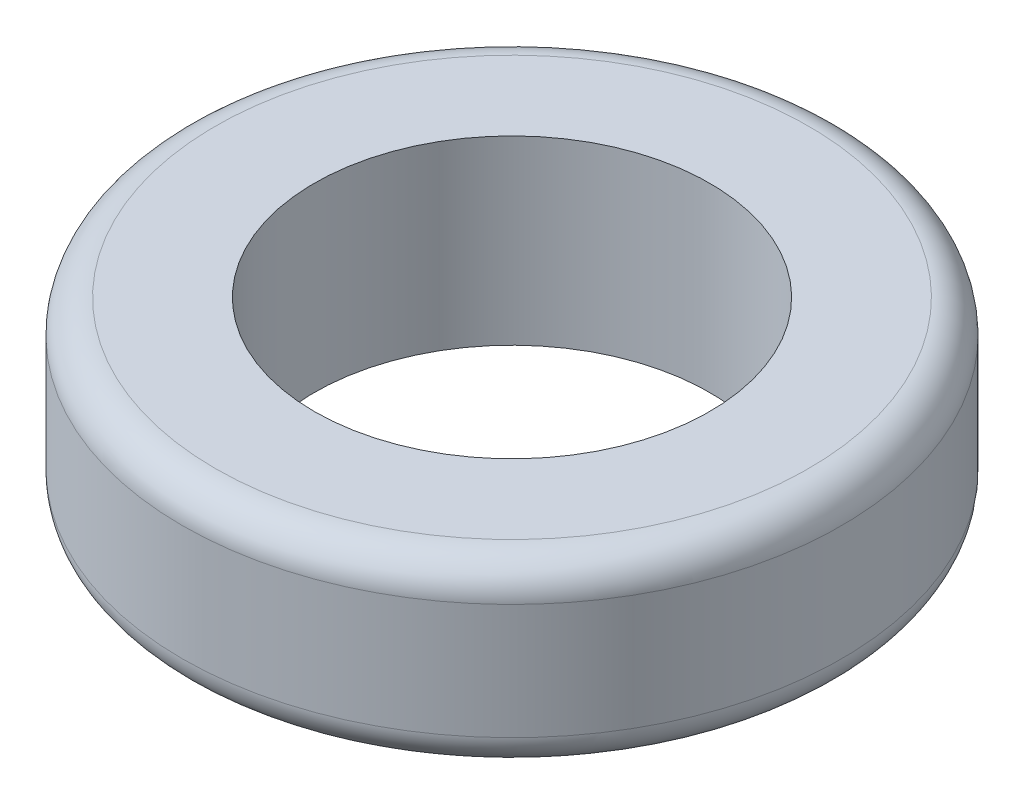
ISO-10303-21;
HEADER;
FILE_DESCRIPTION(('STEP AP214'),'2;1');
FILE_NAME('part.step','',(''),(''),'','','');
FILE_SCHEMA(('AUTOMOTIVE_DESIGN { 1 0 10303 214 1 1 1 1 }'));
ENDSEC;
DATA;
#1=APPLICATION_CONTEXT('core data for automotive mechanical design processes');
#2=APPLICATION_PROTOCOL_DEFINITION('international standard','automotive_design',2000,#1);
#3=PRODUCT_CONTEXT('',#1,'mechanical');
#4=PRODUCT('Part','Part','',(#3));
#5=PRODUCT_RELATED_PRODUCT_CATEGORY('part','',(#4));
#6=PRODUCT_DEFINITION_FORMATION('','',#4);
#7=PRODUCT_DEFINITION_CONTEXT('part definition',#1,'design');
#8=PRODUCT_DEFINITION('design','',#6,#7);
#9=PRODUCT_DEFINITION_SHAPE('','',#8);
#10=(LENGTH_UNIT() NAMED_UNIT(*) SI_UNIT(.MILLI.,.METRE.));
#11=(NAMED_UNIT(*) PLANE_ANGLE_UNIT() SI_UNIT($,.RADIAN.));
#12=(NAMED_UNIT(*) SI_UNIT($,.STERADIAN.) SOLID_ANGLE_UNIT());
#13=UNCERTAINTY_MEASURE_WITH_UNIT(LENGTH_MEASURE(1.E-05),#10,'distance_accuracy_value','');
#14=(GEOMETRIC_REPRESENTATION_CONTEXT(3) GLOBAL_UNCERTAINTY_ASSIGNED_CONTEXT((#13)) GLOBAL_UNIT_ASSIGNED_CONTEXT((#10,
#11,#12)) REPRESENTATION_CONTEXT('',''));
#15=CARTESIAN_POINT('',(0.,0.,0.));
#16=DIRECTION('',(0.,0.,1.));
#17=DIRECTION('',(1.,0.,0.));
#18=AXIS2_PLACEMENT_3D('',#15,#16,#17);
#19=CARTESIAN_POINT('',(0.,5.5,0.));
#20=DIRECTION('',(0.,1.,0.));
#21=DIRECTION('',(0.,0.,1.));
#22=AXIS2_PLACEMENT_3D('',#19,#20,#21);
#23=PLANE('',#22);
#24=CARTESIAN_POINT('',(0.,5.5,0.));
#25=DIRECTION('',(0.,1.,0.));
#26=DIRECTION('',(0.,0.,1.));
#27=AXIS2_PLACEMENT_3D('',#24,#25,#26);
#28=CIRCLE('',#27,9.);
#29=CARTESIAN_POINT('',(0.,5.5,9.));
#30=VERTEX_POINT('',#29);
#31=EDGE_CURVE('E10',#30,#30,#28,.T.);
#32=ORIENTED_EDGE('',*,*,#31,.T.);
#33=EDGE_LOOP('',(#32));
#34=FACE_BOUND('',#33,.T.);
#35=CARTESIAN_POINT('',(0.,5.5,0.));
#36=DIRECTION('',(0.,1.,0.));
#37=DIRECTION('',(0.,0.,1.));
#38=AXIS2_PLACEMENT_3D('',#35,#36,#37);
#39=CIRCLE('',#38,6.);
#40=CARTESIAN_POINT('',(0.,5.5,6.));
#41=VERTEX_POINT('',#40);
#42=EDGE_CURVE('E61',#41,#41,#39,.T.);
#43=ORIENTED_EDGE('',*,*,#42,.F.);
#44=EDGE_LOOP('',(#43));
#45=FACE_BOUND('',#44,.T.);
#46=ADVANCED_FACE('F37',(#34,#45),#23,.T.);
#47=CARTESIAN_POINT('',(0.,0.,0.));
#48=DIRECTION('',(0.,1.,0.));
#49=DIRECTION('',(0.,0.,1.));
#50=AXIS2_PLACEMENT_3D('',#47,#48,#49);
#51=PLANE('',#50);
#52=CARTESIAN_POINT('',(0.,0.,0.));
#53=DIRECTION('',(0.,1.,0.));
#54=DIRECTION('',(0.,0.,1.));
#55=AXIS2_PLACEMENT_3D('',#52,#53,#54);
#56=CIRCLE('',#55,9.);
#57=CARTESIAN_POINT('',(0.,0.,9.));
#58=VERTEX_POINT('',#57);
#59=EDGE_CURVE('E45',#58,#58,#56,.F.);
#60=ORIENTED_EDGE('',*,*,#59,.T.);
#61=EDGE_LOOP('',(#60));
#62=FACE_BOUND('',#61,.T.);
#63=CARTESIAN_POINT('',(0.,0.,0.));
#64=DIRECTION('',(0.,1.,0.));
#65=DIRECTION('',(0.,0.,1.));
#66=AXIS2_PLACEMENT_3D('',#63,#64,#65);
#67=CIRCLE('',#66,6.);
#68=CARTESIAN_POINT('',(0.,0.,6.));
#69=VERTEX_POINT('',#68);
#70=EDGE_CURVE('E62',#69,#69,#67,.T.);
#71=ORIENTED_EDGE('',*,*,#70,.T.);
#72=EDGE_LOOP('',(#71));
#73=FACE_BOUND('',#72,.T.);
#74=ADVANCED_FACE('F74',(#62,#73),#51,.F.);
#75=CARTESIAN_POINT('',(0.,5.5,0.));
#76=DIRECTION('',(0.,-1.,0.));
#77=DIRECTION('',(0.,0.,-1.));
#78=AXIS2_PLACEMENT_3D('',#75,#76,#77);
#79=CYLINDRICAL_SURFACE('',#78,10.);
#80=CARTESIAN_POINT('',(0.,1.,0.));
#81=DIRECTION('',(0.,1.,0.));
#82=DIRECTION('',(0.,0.,1.));
#83=AXIS2_PLACEMENT_3D('',#80,#81,#82);
#84=CIRCLE('',#83,10.);
#85=CARTESIAN_POINT('',(0.,1.,10.));
#86=VERTEX_POINT('',#85);
#87=EDGE_CURVE('E50',#86,#86,#84,.T.);
#88=ORIENTED_EDGE('',*,*,#87,.T.);
#89=EDGE_LOOP('',(#88));
#90=FACE_BOUND('',#89,.T.);
#91=CARTESIAN_POINT('',(0.,4.5,0.));
#92=DIRECTION('',(0.,1.,0.));
#93=DIRECTION('',(0.,0.,1.));
#94=AXIS2_PLACEMENT_3D('',#91,#92,#93);
#95=CIRCLE('',#94,10.);
#96=CARTESIAN_POINT('',(0.,4.5,10.));
#97=VERTEX_POINT('',#96);
#98=EDGE_CURVE('E55',#97,#97,#95,.F.);
#99=ORIENTED_EDGE('',*,*,#98,.T.);
#100=EDGE_LOOP('',(#99));
#101=FACE_BOUND('',#100,.T.);
#102=ADVANCED_FACE('F79',(#90,#101),#79,.T.);
#103=CARTESIAN_POINT('',(0.,5.5,0.));
#104=DIRECTION('',(0.,-1.,0.));
#105=DIRECTION('',(0.,0.,-1.));
#106=AXIS2_PLACEMENT_3D('',#103,#104,#105);
#107=CYLINDRICAL_SURFACE('',#106,6.);
#108=ORIENTED_EDGE('',*,*,#42,.T.);
#109=EDGE_LOOP('',(#108));
#110=FACE_BOUND('',#109,.T.);
#111=ORIENTED_EDGE('',*,*,#70,.F.);
#112=EDGE_LOOP('',(#111));
#113=FACE_BOUND('',#112,.T.);
#114=ADVANCED_FACE('F70',(#110,#113),#107,.F.);
#115=CARTESIAN_POINT('',(0.,1.,0.));
#116=DIRECTION('',(0.,1.,0.));
#117=DIRECTION('',(0.,0.,1.));
#118=AXIS2_PLACEMENT_3D('',#115,#116,#117);
#119=TOROIDAL_SURFACE('',#118,9.,1.);
#120=ORIENTED_EDGE('',*,*,#59,.F.);
#121=EDGE_LOOP('',(#120));
#122=FACE_BOUND('',#121,.T.);
#123=ORIENTED_EDGE('',*,*,#87,.F.);
#124=EDGE_LOOP('',(#123));
#125=FACE_BOUND('',#124,.T.);
#126=ADVANCED_FACE('F85',(#122,#125),#119,.T.);
#127=CARTESIAN_POINT('',(0.,4.5,0.));
#128=DIRECTION('',(0.,1.,0.));
#129=DIRECTION('',(0.,0.,1.));
#130=AXIS2_PLACEMENT_3D('',#127,#128,#129);
#131=TOROIDAL_SURFACE('',#130,9.,1.);
#132=ORIENTED_EDGE('',*,*,#98,.F.);
#133=EDGE_LOOP('',(#132));
#134=FACE_BOUND('',#133,.T.);
#135=ORIENTED_EDGE('',*,*,#31,.F.);
#136=EDGE_LOOP('',(#135));
#137=FACE_BOUND('',#136,.T.);
#138=ADVANCED_FACE('F39',(#134,#137),#131,.T.);
#139=CLOSED_SHELL('',(#46,#74,#102,#114,#126,#138));
#140=MANIFOLD_SOLID_BREP('B2',#139);
#141=ADVANCED_BREP_SHAPE_REPRESENTATION('',(#18,#140),#14);
#142=SHAPE_DEFINITION_REPRESENTATION(#9,#141);
ENDSEC;
END-ISO-10303-21;
